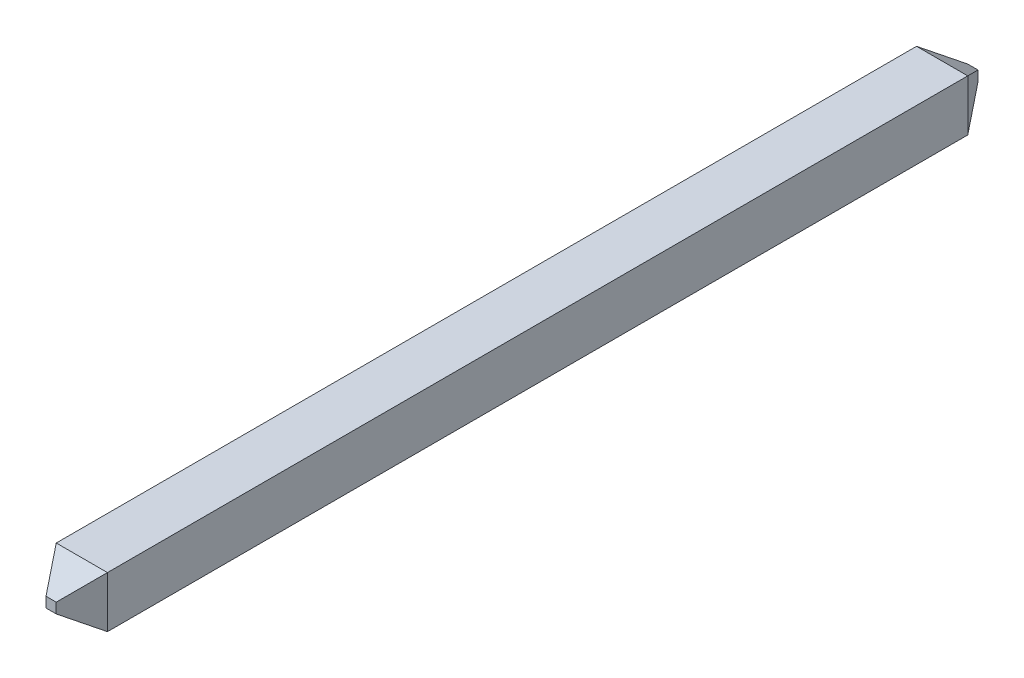
ISO-10303-21;
HEADER;
FILE_DESCRIPTION(('STEP AP214'),'2;1');
FILE_NAME('part.step','',(''),(''),'','','');
FILE_SCHEMA(('AUTOMOTIVE_DESIGN { 1 0 10303 214 1 1 1 1 }'));
ENDSEC;
DATA;
#1=APPLICATION_CONTEXT('core data for automotive mechanical design processes');
#2=APPLICATION_PROTOCOL_DEFINITION('international standard','automotive_design',2000,#1);
#3=PRODUCT_CONTEXT('',#1,'mechanical');
#4=PRODUCT('Part','Part','',(#3));
#5=PRODUCT_RELATED_PRODUCT_CATEGORY('part','',(#4));
#6=PRODUCT_DEFINITION_FORMATION('','',#4);
#7=PRODUCT_DEFINITION_CONTEXT('part definition',#1,'design');
#8=PRODUCT_DEFINITION('design','',#6,#7);
#9=PRODUCT_DEFINITION_SHAPE('','',#8);
#10=(LENGTH_UNIT() NAMED_UNIT(*) SI_UNIT(.MILLI.,.METRE.));
#11=(NAMED_UNIT(*) PLANE_ANGLE_UNIT() SI_UNIT($,.RADIAN.));
#12=(NAMED_UNIT(*) SI_UNIT($,.STERADIAN.) SOLID_ANGLE_UNIT());
#13=UNCERTAINTY_MEASURE_WITH_UNIT(LENGTH_MEASURE(1.E-05),#10,'distance_accuracy_value','');
#14=(GEOMETRIC_REPRESENTATION_CONTEXT(3) GLOBAL_UNCERTAINTY_ASSIGNED_CONTEXT((#13)) GLOBAL_UNIT_ASSIGNED_CONTEXT((#10,
#11,#12)) REPRESENTATION_CONTEXT('',''));
#15=CARTESIAN_POINT('',(0.,0.,0.));
#16=DIRECTION('',(0.,0.,1.));
#17=DIRECTION('',(1.,0.,0.));
#18=AXIS2_PLACEMENT_3D('',#15,#16,#17);
#19=CARTESIAN_POINT('',(0.,12.6365,-6.35));
#20=DIRECTION('',(0.,0.832050294337843,0.554700196225231));
#21=DIRECTION('',(0.,-0.554700196225231,0.832050294337843));
#22=AXIS2_PLACEMENT_3D('',#19,#20,#21);
#23=PLANE('',#22);
#24=DIRECTION('',(1.,0.,0.));
#25=VECTOR('',#24,1.);
#26=CARTESIAN_POINT('',(0.3175,12.3825,-5.969));
#27=LINE('',#26,#25);
#28=CARTESIAN_POINT('',(-0.3175,12.3825,-5.969));
#29=VERTEX_POINT('',#28);
#30=CARTESIAN_POINT('',(0.3175,12.3825,-5.969));
#31=VERTEX_POINT('',#30);
#32=EDGE_CURVE('E103',#29,#31,#27,.T.);
#33=ORIENTED_EDGE('',*,*,#32,.F.);
#34=DIRECTION('',(0.485071250072667,0.485071250072665,-0.727606875108999));
#35=VECTOR('',#34,1.);
#36=CARTESIAN_POINT('',(-0.3175,12.3825,-5.969));
#37=LINE('',#36,#35);
#38=CARTESIAN_POINT('',(-0.0635,12.6365,-6.35));
#39=VERTEX_POINT('',#38);
#40=EDGE_CURVE('E78',#29,#39,#37,.T.);
#41=ORIENTED_EDGE('',*,*,#40,.T.);
#42=DIRECTION('',(-1.,0.,0.));
#43=VECTOR('',#42,1.);
#44=CARTESIAN_POINT('',(0.,12.6365,-6.35));
#45=LINE('',#44,#43);
#46=CARTESIAN_POINT('',(0.0635,12.6365,-6.35));
#47=VERTEX_POINT('',#46);
#48=EDGE_CURVE('E19',#47,#39,#45,.T.);
#49=ORIENTED_EDGE('',*,*,#48,.F.);
#50=DIRECTION('',(0.485071250072667,-0.485071250072665,0.727606875108999));
#51=VECTOR('',#50,1.);
#52=CARTESIAN_POINT('',(0.0635,12.6365,-6.35));
#53=LINE('',#52,#51);
#54=EDGE_CURVE('E82',#47,#31,#53,.T.);
#55=ORIENTED_EDGE('',*,*,#54,.T.);
#56=EDGE_LOOP('',(#33,#41,#49,#55));
#57=FACE_BOUND('',#56,.T.);
#58=ADVANCED_FACE('F16',(#57),#23,.F.);
#59=CARTESIAN_POINT('',(0.3175,12.3825,4.699));
#60=DIRECTION('',(0.,-0.832050294337843,0.55470019622523));
#61=DIRECTION('',(0.,-0.55470019622523,-0.832050294337843));
#62=AXIS2_PLACEMENT_3D('',#59,#60,#61);
#63=PLANE('',#62);
#64=DIRECTION('',(0.485071250072666,0.485071250072664,0.727606875109));
#65=VECTOR('',#64,1.);
#66=CARTESIAN_POINT('',(-0.3175,12.3825,4.699));
#67=LINE('',#66,#65);
#68=CARTESIAN_POINT('',(-0.3175,12.3825,4.699));
#69=VERTEX_POINT('',#68);
#70=CARTESIAN_POINT('',(-0.0634999999999999,12.6365,5.08));
#71=VERTEX_POINT('',#70);
#72=EDGE_CURVE('E111',#69,#71,#67,.T.);
#73=ORIENTED_EDGE('',*,*,#72,.F.);
#74=DIRECTION('',(1.,0.,0.));
#75=VECTOR('',#74,1.);
#76=CARTESIAN_POINT('',(0.3175,12.3825,4.699));
#77=LINE('',#76,#75);
#78=CARTESIAN_POINT('',(0.3175,12.3825,4.699));
#79=VERTEX_POINT('',#78);
#80=EDGE_CURVE('E105',#79,#69,#77,.F.);
#81=ORIENTED_EDGE('',*,*,#80,.F.);
#82=DIRECTION('',(0.485071250072666,-0.485071250072664,-0.727606875109));
#83=VECTOR('',#82,1.);
#84=CARTESIAN_POINT('',(0.0635,12.6365,5.08));
#85=LINE('',#84,#83);
#86=CARTESIAN_POINT('',(0.0635,12.6365,5.08));
#87=VERTEX_POINT('',#86);
#88=EDGE_CURVE('E108',#87,#79,#85,.T.);
#89=ORIENTED_EDGE('',*,*,#88,.F.);
#90=DIRECTION('',(-1.,0.,0.));
#91=VECTOR('',#90,1.);
#92=CARTESIAN_POINT('',(0.,12.6365,5.08));
#93=LINE('',#92,#91);
#94=EDGE_CURVE('E117',#87,#71,#93,.T.);
#95=ORIENTED_EDGE('',*,*,#94,.T.);
#96=EDGE_LOOP('',(#73,#81,#89,#95));
#97=FACE_BOUND('',#96,.T.);
#98=ADVANCED_FACE('F175',(#97),#63,.T.);
#99=CARTESIAN_POINT('',(0.,0.,-6.35));
#100=DIRECTION('',(0.,0.,-1.));
#101=DIRECTION('',(-1.,0.,0.));
#102=AXIS2_PLACEMENT_3D('',#99,#100,#101);
#103=PLANE('',#102);
#104=DIRECTION('',(0.,1.,0.));
#105=VECTOR('',#104,1.);
#106=CARTESIAN_POINT('',(-0.0635,0.,-6.35));
#107=LINE('',#106,#105);
#108=CARTESIAN_POINT('',(-0.0635,12.7635,-6.35));
#109=VERTEX_POINT('',#108);
#110=EDGE_CURVE('E99',#39,#109,#107,.T.);
#111=ORIENTED_EDGE('',*,*,#110,.T.);
#112=DIRECTION('',(1.,0.,0.));
#113=VECTOR('',#112,1.);
#114=CARTESIAN_POINT('',(0.,12.7635,-6.35));
#115=LINE('',#114,#113);
#116=CARTESIAN_POINT('',(0.0635,12.7635,-6.35));
#117=VERTEX_POINT('',#116);
#118=EDGE_CURVE('E90',#109,#117,#115,.T.);
#119=ORIENTED_EDGE('',*,*,#118,.T.);
#120=DIRECTION('',(0.,1.,0.));
#121=VECTOR('',#120,1.);
#122=CARTESIAN_POINT('',(0.0635,0.,-6.35));
#123=LINE('',#122,#121);
#124=EDGE_CURVE('E86',#117,#47,#123,.F.);
#125=ORIENTED_EDGE('',*,*,#124,.T.);
#126=ORIENTED_EDGE('',*,*,#48,.T.);
#127=EDGE_LOOP('',(#111,#119,#125,#126));
#128=FACE_BOUND('',#127,.T.);
#129=ADVANCED_FACE('F88',(#128),#103,.T.);
#130=CARTESIAN_POINT('',(0.0635,0.,-6.35));
#131=DIRECTION('',(-0.832050294337843,0.,0.55470019622523));
#132=DIRECTION('',(0.55470019622523,0.,0.832050294337843));
#133=AXIS2_PLACEMENT_3D('',#130,#131,#132);
#134=PLANE('',#133);
#135=DIRECTION('',(0.,1.,0.));
#136=VECTOR('',#135,1.);
#137=CARTESIAN_POINT('',(0.3175,13.0175,-5.969));
#138=LINE('',#137,#136);
#139=CARTESIAN_POINT('',(0.3175,13.0175,-5.969));
#140=VERTEX_POINT('',#139);
#141=EDGE_CURVE('E96',#31,#140,#138,.T.);
#142=ORIENTED_EDGE('',*,*,#141,.F.);
#143=ORIENTED_EDGE('',*,*,#54,.F.);
#144=ORIENTED_EDGE('',*,*,#124,.F.);
#145=DIRECTION('',(0.485071250072667,0.485071250072668,0.727606875108997));
#146=VECTOR('',#145,1.);
#147=CARTESIAN_POINT('',(0.0635,12.7635,-6.35));
#148=LINE('',#147,#146);
#149=EDGE_CURVE('E128',#117,#140,#148,.T.);
#150=ORIENTED_EDGE('',*,*,#149,.T.);
#151=EDGE_LOOP('',(#142,#143,#144,#150));
#152=FACE_BOUND('',#151,.T.);
#153=ADVANCED_FACE('F94',(#152),#134,.F.);
#154=CARTESIAN_POINT('',(-0.0635,0.,-6.35));
#155=DIRECTION('',(0.832050294337843,0.,0.55470019622523));
#156=DIRECTION('',(0.55470019622523,0.,-0.832050294337843));
#157=AXIS2_PLACEMENT_3D('',#154,#155,#156);
#158=PLANE('',#157);
#159=ORIENTED_EDGE('',*,*,#110,.F.);
#160=ORIENTED_EDGE('',*,*,#40,.F.);
#161=DIRECTION('',(0.,1.,0.));
#162=VECTOR('',#161,1.);
#163=CARTESIAN_POINT('',(-0.3175,12.3825,-5.969));
#164=LINE('',#163,#162);
#165=CARTESIAN_POINT('',(-0.3175,13.0175,-5.969));
#166=VERTEX_POINT('',#165);
#167=EDGE_CURVE('E133',#166,#29,#164,.F.);
#168=ORIENTED_EDGE('',*,*,#167,.F.);
#169=DIRECTION('',(0.485071250072667,-0.485071250072668,-0.727606875108997));
#170=VECTOR('',#169,1.);
#171=CARTESIAN_POINT('',(-0.3175,13.0175,-5.969));
#172=LINE('',#171,#170);
#173=EDGE_CURVE('E130',#166,#109,#172,.T.);
#174=ORIENTED_EDGE('',*,*,#173,.T.);
#175=EDGE_LOOP('',(#159,#160,#168,#174));
#176=FACE_BOUND('',#175,.T.);
#177=ADVANCED_FACE('F208',(#176),#158,.F.);
#178=CARTESIAN_POINT('',(0.3175,12.3825,5.08));
#179=DIRECTION('',(0.,-1.,0.));
#180=DIRECTION('',(0.,0.,-1.));
#181=AXIS2_PLACEMENT_3D('',#178,#179,#180);
#182=PLANE('',#181);
#183=DIRECTION('',(0.,0.,-1.));
#184=VECTOR('',#183,1.);
#185=CARTESIAN_POINT('',(0.3175,12.3825,5.08));
#186=LINE('',#185,#184);
#187=EDGE_CURVE('E121',#79,#31,#186,.T.);
#188=ORIENTED_EDGE('',*,*,#187,.F.);
#189=ORIENTED_EDGE('',*,*,#80,.T.);
#190=DIRECTION('',(0.,0.,1.));
#191=VECTOR('',#190,1.);
#192=CARTESIAN_POINT('',(-0.3175,12.3825,5.08));
#193=LINE('',#192,#191);
#194=EDGE_CURVE('E136',#29,#69,#193,.T.);
#195=ORIENTED_EDGE('',*,*,#194,.F.);
#196=ORIENTED_EDGE('',*,*,#32,.T.);
#197=EDGE_LOOP('',(#188,#189,#195,#196));
#198=FACE_BOUND('',#197,.T.);
#199=ADVANCED_FACE('F186',(#198),#182,.T.);
#200=CARTESIAN_POINT('',(0.3175,13.0175,4.699));
#201=DIRECTION('',(0.832050294337844,0.,0.554700196225229));
#202=DIRECTION('',(0.554700196225229,0.,-0.832050294337844));
#203=AXIS2_PLACEMENT_3D('',#200,#201,#202);
#204=PLANE('',#203);
#205=ORIENTED_EDGE('',*,*,#88,.T.);
#206=DIRECTION('',(0.,1.,0.));
#207=VECTOR('',#206,1.);
#208=CARTESIAN_POINT('',(0.3175,13.0175,4.699));
#209=LINE('',#208,#207);
#210=CARTESIAN_POINT('',(0.3175,13.0175,4.699));
#211=VERTEX_POINT('',#210);
#212=EDGE_CURVE('E124',#211,#79,#209,.F.);
#213=ORIENTED_EDGE('',*,*,#212,.F.);
#214=DIRECTION('',(0.485071250072666,0.485071250072667,-0.727606875108998));
#215=VECTOR('',#214,1.);
#216=CARTESIAN_POINT('',(0.0635,12.7635,5.08));
#217=LINE('',#216,#215);
#218=CARTESIAN_POINT('',(0.0635,12.7635,5.08));
#219=VERTEX_POINT('',#218);
#220=EDGE_CURVE('E141',#219,#211,#217,.T.);
#221=ORIENTED_EDGE('',*,*,#220,.F.);
#222=DIRECTION('',(0.,1.,0.));
#223=VECTOR('',#222,1.);
#224=CARTESIAN_POINT('',(0.0635,0.,5.08));
#225=LINE('',#224,#223);
#226=EDGE_CURVE('E114',#219,#87,#225,.F.);
#227=ORIENTED_EDGE('',*,*,#226,.T.);
#228=EDGE_LOOP('',(#205,#213,#221,#227));
#229=FACE_BOUND('',#228,.T.);
#230=ADVANCED_FACE('F168',(#229),#204,.T.);
#231=CARTESIAN_POINT('',(-0.3175,12.3825,4.699));
#232=DIRECTION('',(-0.832050294337844,0.,0.554700196225229));
#233=DIRECTION('',(0.554700196225229,0.,0.832050294337844));
#234=AXIS2_PLACEMENT_3D('',#231,#232,#233);
#235=PLANE('',#234);
#236=DIRECTION('',(0.485071250072666,-0.485071250072667,0.727606875108998));
#237=VECTOR('',#236,1.);
#238=CARTESIAN_POINT('',(-0.3175,13.0175,4.699));
#239=LINE('',#238,#237);
#240=CARTESIAN_POINT('',(-0.3175,13.0175,4.699));
#241=VERTEX_POINT('',#240);
#242=CARTESIAN_POINT('',(-0.0635,12.7635,5.08));
#243=VERTEX_POINT('',#242);
#244=EDGE_CURVE('E34',#241,#243,#239,.T.);
#245=ORIENTED_EDGE('',*,*,#244,.F.);
#246=DIRECTION('',(0.,1.,0.));
#247=VECTOR('',#246,1.);
#248=CARTESIAN_POINT('',(-0.3175,12.3825,4.699));
#249=LINE('',#248,#247);
#250=EDGE_CURVE('E139',#69,#241,#249,.T.);
#251=ORIENTED_EDGE('',*,*,#250,.F.);
#252=ORIENTED_EDGE('',*,*,#72,.T.);
#253=DIRECTION('',(0.,1.,0.));
#254=VECTOR('',#253,1.);
#255=CARTESIAN_POINT('',(-0.0635,0.,5.08));
#256=LINE('',#255,#254);
#257=EDGE_CURVE('E119',#71,#243,#256,.T.);
#258=ORIENTED_EDGE('',*,*,#257,.T.);
#259=EDGE_LOOP('',(#245,#251,#252,#258));
#260=FACE_BOUND('',#259,.T.);
#261=ADVANCED_FACE('F176',(#260),#235,.T.);
#262=CARTESIAN_POINT('',(0.,0.,5.08));
#263=DIRECTION('',(0.,0.,-1.));
#264=DIRECTION('',(-1.,0.,0.));
#265=AXIS2_PLACEMENT_3D('',#262,#263,#264);
#266=PLANE('',#265);
#267=ORIENTED_EDGE('',*,*,#257,.F.);
#268=ORIENTED_EDGE('',*,*,#94,.F.);
#269=ORIENTED_EDGE('',*,*,#226,.F.);
#270=DIRECTION('',(1.,0.,0.));
#271=VECTOR('',#270,1.);
#272=CARTESIAN_POINT('',(-0.3175,12.7635,5.08));
#273=LINE('',#272,#271);
#274=EDGE_CURVE('E145',#243,#219,#273,.T.);
#275=ORIENTED_EDGE('',*,*,#274,.F.);
#276=EDGE_LOOP('',(#267,#268,#269,#275));
#277=FACE_BOUND('',#276,.T.);
#278=ADVANCED_FACE('F173',(#277),#266,.F.);
#279=CARTESIAN_POINT('',(0.3175,13.0175,5.08));
#280=DIRECTION('',(1.,0.,0.));
#281=DIRECTION('',(0.,0.,-1.));
#282=AXIS2_PLACEMENT_3D('',#279,#280,#281);
#283=PLANE('',#282);
#284=DIRECTION('',(0.,0.,1.));
#285=VECTOR('',#284,1.);
#286=CARTESIAN_POINT('',(0.3175,13.0175,5.08));
#287=LINE('',#286,#285);
#288=EDGE_CURVE('E148',#211,#140,#287,.F.);
#289=ORIENTED_EDGE('',*,*,#288,.F.);
#290=ORIENTED_EDGE('',*,*,#212,.T.);
#291=ORIENTED_EDGE('',*,*,#187,.T.);
#292=ORIENTED_EDGE('',*,*,#141,.T.);
#293=EDGE_LOOP('',(#289,#290,#291,#292));
#294=FACE_BOUND('',#293,.T.);
#295=ADVANCED_FACE('F184',(#294),#283,.T.);
#296=CARTESIAN_POINT('',(0.,12.7635,-6.35));
#297=DIRECTION('',(0.,-0.832050294337843,0.554700196225231));
#298=DIRECTION('',(0.,-0.554700196225231,-0.832050294337843));
#299=AXIS2_PLACEMENT_3D('',#296,#297,#298);
#300=PLANE('',#299);
#301=DIRECTION('',(1.,0.,0.));
#302=VECTOR('',#301,1.);
#303=CARTESIAN_POINT('',(-0.3175,13.0175,-5.969));
#304=LINE('',#303,#302);
#305=EDGE_CURVE('E151',#140,#166,#304,.F.);
#306=ORIENTED_EDGE('',*,*,#305,.F.);
#307=ORIENTED_EDGE('',*,*,#149,.F.);
#308=ORIENTED_EDGE('',*,*,#118,.F.);
#309=ORIENTED_EDGE('',*,*,#173,.F.);
#310=EDGE_LOOP('',(#306,#307,#308,#309));
#311=FACE_BOUND('',#310,.T.);
#312=ADVANCED_FACE('F197',(#311),#300,.F.);
#313=CARTESIAN_POINT('',(-0.3175,12.3825,5.08));
#314=DIRECTION('',(-1.,0.,0.));
#315=DIRECTION('',(0.,0.,1.));
#316=AXIS2_PLACEMENT_3D('',#313,#314,#315);
#317=PLANE('',#316);
#318=ORIENTED_EDGE('',*,*,#194,.T.);
#319=ORIENTED_EDGE('',*,*,#250,.T.);
#320=DIRECTION('',(0.,0.,1.));
#321=VECTOR('',#320,1.);
#322=CARTESIAN_POINT('',(-0.3175,13.0175,5.08));
#323=LINE('',#322,#321);
#324=EDGE_CURVE('E25',#166,#241,#323,.T.);
#325=ORIENTED_EDGE('',*,*,#324,.F.);
#326=ORIENTED_EDGE('',*,*,#167,.T.);
#327=EDGE_LOOP('',(#318,#319,#325,#326));
#328=FACE_BOUND('',#327,.T.);
#329=ADVANCED_FACE('F161',(#328),#317,.T.);
#330=CARTESIAN_POINT('',(-0.3175,13.0175,4.699));
#331=DIRECTION('',(0.,0.832050294337843,0.55470019622523));
#332=DIRECTION('',(0.,-0.55470019622523,0.832050294337843));
#333=AXIS2_PLACEMENT_3D('',#330,#331,#332);
#334=PLANE('',#333);
#335=ORIENTED_EDGE('',*,*,#244,.T.);
#336=ORIENTED_EDGE('',*,*,#274,.T.);
#337=ORIENTED_EDGE('',*,*,#220,.T.);
#338=DIRECTION('',(1.,0.,0.));
#339=VECTOR('',#338,1.);
#340=CARTESIAN_POINT('',(-0.3175,13.0175,4.699));
#341=LINE('',#340,#339);
#342=EDGE_CURVE('E11',#241,#211,#341,.T.);
#343=ORIENTED_EDGE('',*,*,#342,.F.);
#344=EDGE_LOOP('',(#335,#336,#337,#343));
#345=FACE_BOUND('',#344,.T.);
#346=ADVANCED_FACE('F164',(#345),#334,.T.);
#347=CARTESIAN_POINT('',(-0.3175,13.0175,5.08));
#348=DIRECTION('',(0.,1.,0.));
#349=DIRECTION('',(0.,0.,1.));
#350=AXIS2_PLACEMENT_3D('',#347,#348,#349);
#351=PLANE('',#350);
#352=ORIENTED_EDGE('',*,*,#324,.T.);
#353=ORIENTED_EDGE('',*,*,#342,.T.);
#354=ORIENTED_EDGE('',*,*,#288,.T.);
#355=ORIENTED_EDGE('',*,*,#305,.T.);
#356=EDGE_LOOP('',(#352,#353,#354,#355));
#357=FACE_BOUND('',#356,.T.);
#358=ADVANCED_FACE('F157',(#357),#351,.T.);
#359=CLOSED_SHELL('',(#58,#98,#129,#153,#177,#199,#230,#261,#278,#295,#312,#329,#346,#358));
#360=MANIFOLD_SOLID_BREP('B1',#359);
#361=ADVANCED_BREP_SHAPE_REPRESENTATION('',(#18,#360),#14);
#362=SHAPE_DEFINITION_REPRESENTATION(#9,#361);
ENDSEC;
END-ISO-10303-21;
